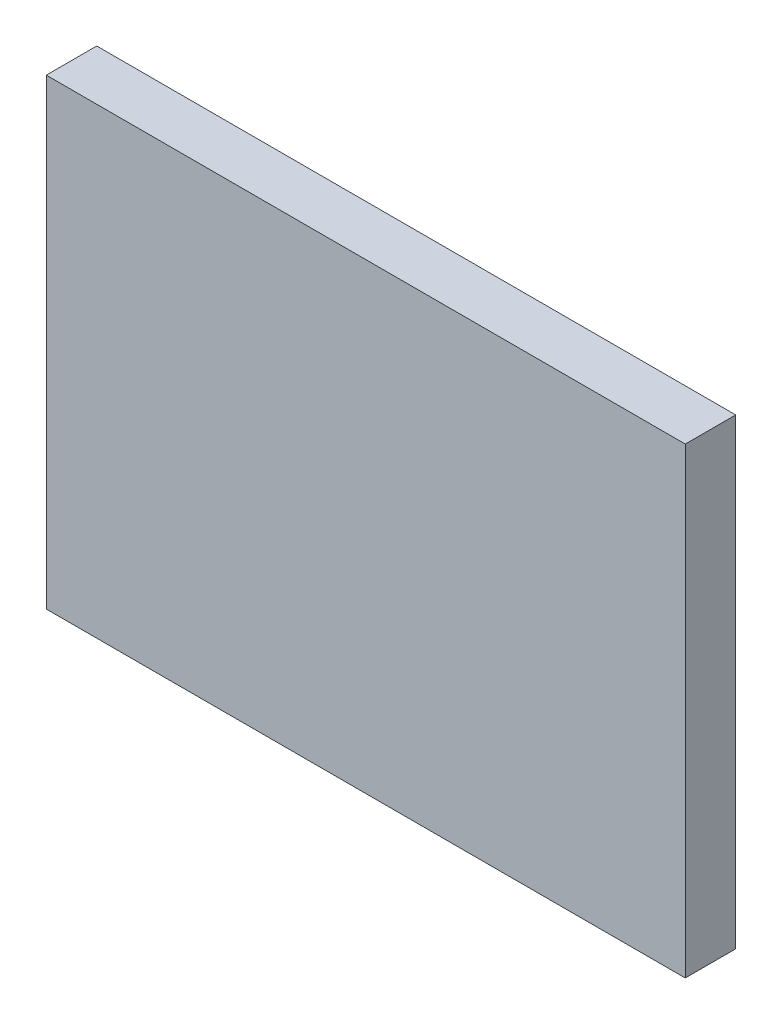
ISO-10303-21;
HEADER;
FILE_DESCRIPTION(('STEP AP214'),'2;1');
FILE_NAME('part.step','',(''),(''),'','','');
FILE_SCHEMA(('AUTOMOTIVE_DESIGN { 1 0 10303 214 1 1 1 1 }'));
ENDSEC;
DATA;
#1=APPLICATION_CONTEXT('core data for automotive mechanical design processes');
#2=APPLICATION_PROTOCOL_DEFINITION('international standard','automotive_design',2000,#1);
#3=PRODUCT_CONTEXT('',#1,'mechanical');
#4=PRODUCT('Part','Part','',(#3));
#5=PRODUCT_RELATED_PRODUCT_CATEGORY('part','',(#4));
#6=PRODUCT_DEFINITION_FORMATION('','',#4);
#7=PRODUCT_DEFINITION_CONTEXT('part definition',#1,'design');
#8=PRODUCT_DEFINITION('design','',#6,#7);
#9=PRODUCT_DEFINITION_SHAPE('','',#8);
#10=(LENGTH_UNIT() NAMED_UNIT(*) SI_UNIT(.MILLI.,.METRE.));
#11=(NAMED_UNIT(*) PLANE_ANGLE_UNIT() SI_UNIT($,.RADIAN.));
#12=(NAMED_UNIT(*) SI_UNIT($,.STERADIAN.) SOLID_ANGLE_UNIT());
#13=UNCERTAINTY_MEASURE_WITH_UNIT(LENGTH_MEASURE(1.E-05),#10,'distance_accuracy_value','');
#14=(GEOMETRIC_REPRESENTATION_CONTEXT(3) GLOBAL_UNCERTAINTY_ASSIGNED_CONTEXT((#13)) GLOBAL_UNIT_ASSIGNED_CONTEXT((#10,
#11,#12)) REPRESENTATION_CONTEXT('',''));
#15=CARTESIAN_POINT('',(0.,0.,0.));
#16=DIRECTION('',(0.,0.,1.));
#17=DIRECTION('',(1.,0.,0.));
#18=AXIS2_PLACEMENT_3D('',#15,#16,#17);
#19=CARTESIAN_POINT('',(-18.9999999999998,-49.5218446547038,3.));
#20=DIRECTION('',(1.,0.,0.));
#21=DIRECTION('',(0.,1.,0.));
#22=AXIS2_PLACEMENT_3D('',#19,#20,#21);
#23=PLANE('',#22);
#24=DIRECTION('',(0.,-1.,0.));
#25=VECTOR('',#24,1.);
#26=CARTESIAN_POINT('',(-18.9999999999998,-49.5218446547038,0.));
#27=LINE('',#26,#25);
#28=CARTESIAN_POINT('',(-18.9999999999998,-49.5218446547038,0.));
#29=VERTEX_POINT('',#28);
#30=CARTESIAN_POINT('',(-18.9999999999998,-77.0218446547038,0.));
#31=VERTEX_POINT('',#30);
#32=EDGE_CURVE('E96',#29,#31,#27,.T.);
#33=ORIENTED_EDGE('',*,*,#32,.T.);
#34=DIRECTION('',(0.,0.,-1.));
#35=VECTOR('',#34,1.);
#36=CARTESIAN_POINT('',(-18.9999999999998,-77.0218446547038,3.));
#37=LINE('',#36,#35);
#38=CARTESIAN_POINT('',(-18.9999999999998,-77.0218446547038,3.));
#39=VERTEX_POINT('',#38);
#40=EDGE_CURVE('E11',#39,#31,#37,.T.);
#41=ORIENTED_EDGE('',*,*,#40,.F.);
#42=DIRECTION('',(0.,-1.,0.));
#43=VECTOR('',#42,1.);
#44=CARTESIAN_POINT('',(-18.9999999999998,-49.5218446547038,3.));
#45=LINE('',#44,#43);
#46=CARTESIAN_POINT('',(-18.9999999999998,-49.5218446547038,3.));
#47=VERTEX_POINT('',#46);
#48=EDGE_CURVE('E84',#47,#39,#45,.T.);
#49=ORIENTED_EDGE('',*,*,#48,.F.);
#50=DIRECTION('',(0.,0.,-1.));
#51=VECTOR('',#50,1.);
#52=CARTESIAN_POINT('',(-18.9999999999998,-49.5218446547038,3.));
#53=LINE('',#52,#51);
#54=EDGE_CURVE('E92',#47,#29,#53,.T.);
#55=ORIENTED_EDGE('',*,*,#54,.T.);
#56=EDGE_LOOP('',(#33,#41,#49,#55));
#57=FACE_BOUND('',#56,.T.);
#58=ADVANCED_FACE('F33',(#57),#23,.F.);
#59=CARTESIAN_POINT('',(-18.9999999999998,-77.0218446547038,3.));
#60=DIRECTION('',(0.,1.,0.));
#61=DIRECTION('',(0.,0.,1.));
#62=AXIS2_PLACEMENT_3D('',#59,#60,#61);
#63=PLANE('',#62);
#64=DIRECTION('',(1.,0.,0.));
#65=VECTOR('',#64,1.);
#66=CARTESIAN_POINT('',(-18.9999999999998,-77.0218446547038,0.));
#67=LINE('',#66,#65);
#68=CARTESIAN_POINT('',(19.0000000000002,-77.0218446547038,0.));
#69=VERTEX_POINT('',#68);
#70=EDGE_CURVE('E88',#31,#69,#67,.T.);
#71=ORIENTED_EDGE('',*,*,#70,.T.);
#72=DIRECTION('',(0.,0.,-1.));
#73=VECTOR('',#72,1.);
#74=CARTESIAN_POINT('',(19.0000000000002,-77.0218446547038,3.));
#75=LINE('',#74,#73);
#76=CARTESIAN_POINT('',(19.0000000000002,-77.0218446547038,3.));
#77=VERTEX_POINT('',#76);
#78=EDGE_CURVE('E41',#77,#69,#75,.T.);
#79=ORIENTED_EDGE('',*,*,#78,.F.);
#80=DIRECTION('',(1.,0.,0.));
#81=VECTOR('',#80,1.);
#82=CARTESIAN_POINT('',(-18.9999999999998,-77.0218446547038,3.));
#83=LINE('',#82,#81);
#84=EDGE_CURVE('E79',#39,#77,#83,.T.);
#85=ORIENTED_EDGE('',*,*,#84,.F.);
#86=ORIENTED_EDGE('',*,*,#40,.T.);
#87=EDGE_LOOP('',(#71,#79,#85,#86));
#88=FACE_BOUND('',#87,.T.);
#89=ADVANCED_FACE('F87',(#88),#63,.F.);
#90=CARTESIAN_POINT('',(19.0000000000002,-49.5218446547038,3.));
#91=DIRECTION('',(-1.,0.,0.));
#92=DIRECTION('',(0.,-1.,0.));
#93=AXIS2_PLACEMENT_3D('',#90,#91,#92);
#94=PLANE('',#93);
#95=DIRECTION('',(0.,1.,0.));
#96=VECTOR('',#95,1.);
#97=CARTESIAN_POINT('',(19.0000000000002,-49.5218446547038,0.));
#98=LINE('',#97,#96);
#99=CARTESIAN_POINT('',(19.0000000000002,-49.5218446547038,0.));
#100=VERTEX_POINT('',#99);
#101=EDGE_CURVE('E66',#69,#100,#98,.T.);
#102=ORIENTED_EDGE('',*,*,#101,.T.);
#103=DIRECTION('',(0.,0.,-1.));
#104=VECTOR('',#103,1.);
#105=CARTESIAN_POINT('',(19.0000000000002,-49.5218446547038,3.));
#106=LINE('',#105,#104);
#107=CARTESIAN_POINT('',(19.0000000000002,-49.5218446547038,3.));
#108=VERTEX_POINT('',#107);
#109=EDGE_CURVE('E89',#108,#100,#106,.T.);
#110=ORIENTED_EDGE('',*,*,#109,.F.);
#111=DIRECTION('',(0.,1.,0.));
#112=VECTOR('',#111,1.);
#113=CARTESIAN_POINT('',(19.0000000000002,-49.5218446547038,3.));
#114=LINE('',#113,#112);
#115=EDGE_CURVE('E82',#77,#108,#114,.T.);
#116=ORIENTED_EDGE('',*,*,#115,.F.);
#117=ORIENTED_EDGE('',*,*,#78,.T.);
#118=EDGE_LOOP('',(#102,#110,#116,#117));
#119=FACE_BOUND('',#118,.T.);
#120=ADVANCED_FACE('F90',(#119),#94,.F.);
#121=CARTESIAN_POINT('',(-18.9999999999998,-49.5218446547038,3.));
#122=DIRECTION('',(0.,-1.,0.));
#123=DIRECTION('',(0.,0.,-1.));
#124=AXIS2_PLACEMENT_3D('',#121,#122,#123);
#125=PLANE('',#124);
#126=DIRECTION('',(-1.,0.,0.));
#127=VECTOR('',#126,1.);
#128=CARTESIAN_POINT('',(-18.9999999999998,-49.5218446547038,0.));
#129=LINE('',#128,#127);
#130=EDGE_CURVE('E72',#100,#29,#129,.T.);
#131=ORIENTED_EDGE('',*,*,#130,.T.);
#132=ORIENTED_EDGE('',*,*,#54,.F.);
#133=DIRECTION('',(-1.,0.,0.));
#134=VECTOR('',#133,1.);
#135=CARTESIAN_POINT('',(-18.9999999999998,-49.5218446547038,3.));
#136=LINE('',#135,#134);
#137=EDGE_CURVE('E49',#108,#47,#136,.T.);
#138=ORIENTED_EDGE('',*,*,#137,.F.);
#139=ORIENTED_EDGE('',*,*,#109,.T.);
#140=EDGE_LOOP('',(#131,#132,#138,#139));
#141=FACE_BOUND('',#140,.T.);
#142=ADVANCED_FACE('F103',(#141),#125,.F.);
#143=CARTESIAN_POINT('',(0.,0.,3.));
#144=DIRECTION('',(0.,0.,1.));
#145=DIRECTION('',(1.,0.,0.));
#146=AXIS2_PLACEMENT_3D('',#143,#144,#145);
#147=PLANE('',#146);
#148=ORIENTED_EDGE('',*,*,#48,.T.);
#149=ORIENTED_EDGE('',*,*,#84,.T.);
#150=ORIENTED_EDGE('',*,*,#115,.T.);
#151=ORIENTED_EDGE('',*,*,#137,.T.);
#152=EDGE_LOOP('',(#148,#149,#150,#151));
#153=FACE_BOUND('',#152,.T.);
#154=ADVANCED_FACE('F80',(#153),#147,.T.);
#155=CARTESIAN_POINT('',(0.,0.,0.));
#156=DIRECTION('',(0.,0.,1.));
#157=DIRECTION('',(1.,0.,0.));
#158=AXIS2_PLACEMENT_3D('',#155,#156,#157);
#159=PLANE('',#158);
#160=ORIENTED_EDGE('',*,*,#32,.F.);
#161=ORIENTED_EDGE('',*,*,#130,.F.);
#162=ORIENTED_EDGE('',*,*,#101,.F.);
#163=ORIENTED_EDGE('',*,*,#70,.F.);
#164=EDGE_LOOP('',(#160,#161,#162,#163));
#165=FACE_BOUND('',#164,.T.);
#166=ADVANCED_FACE('F106',(#165),#159,.F.);
#167=CLOSED_SHELL('',(#58,#89,#120,#142,#154,#166));
#168=MANIFOLD_SOLID_BREP('B2',#167);
#169=ADVANCED_BREP_SHAPE_REPRESENTATION('',(#18,#168),#14);
#170=SHAPE_DEFINITION_REPRESENTATION(#9,#169);
ENDSEC;
END-ISO-10303-21;
